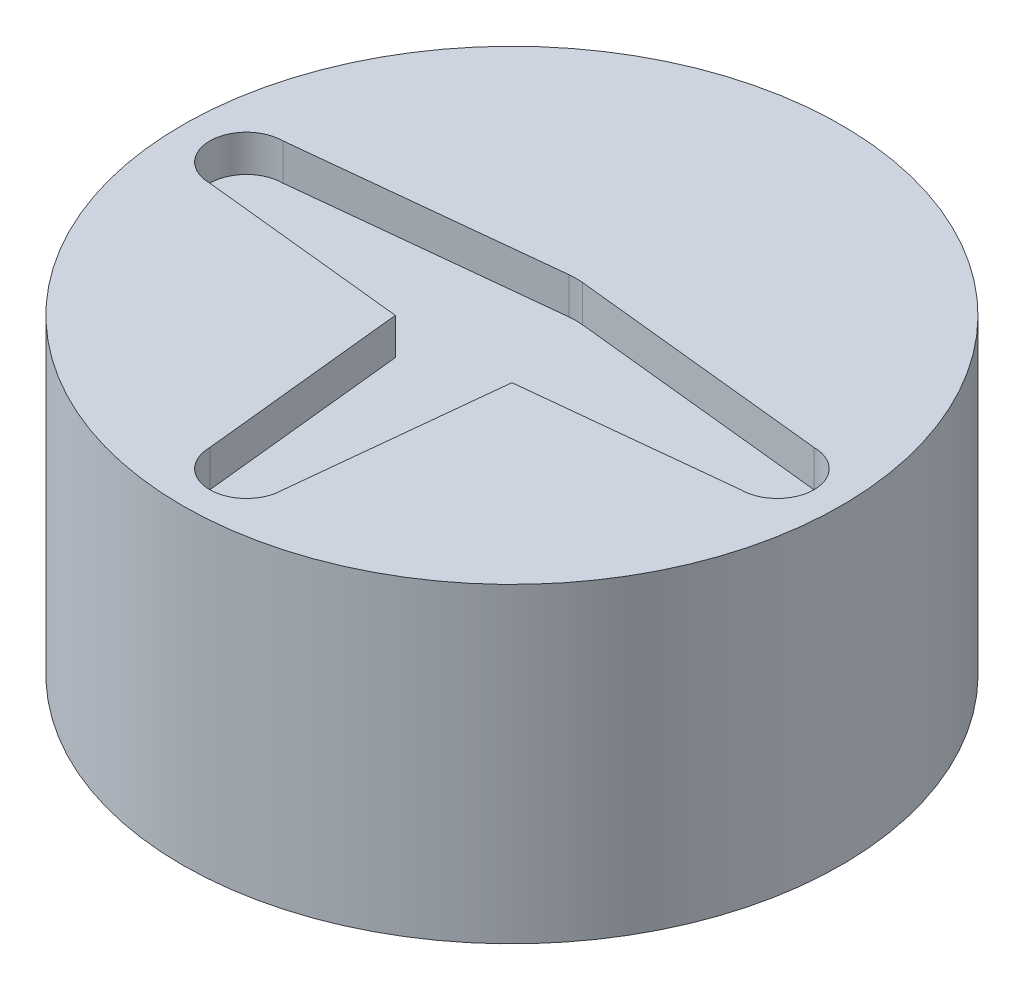
ISO-10303-21;
HEADER;
FILE_DESCRIPTION(('STEP AP214'),'2;1');
FILE_NAME('part.step','',(''),(''),'','','');
FILE_SCHEMA(('AUTOMOTIVE_DESIGN { 1 0 10303 214 1 1 1 1 }'));
ENDSEC;
DATA;
#1=APPLICATION_CONTEXT('core data for automotive mechanical design processes');
#2=APPLICATION_PROTOCOL_DEFINITION('international standard','automotive_design',2000,#1);
#3=PRODUCT_CONTEXT('',#1,'mechanical');
#4=PRODUCT('Part','Part','',(#3));
#5=PRODUCT_RELATED_PRODUCT_CATEGORY('part','',(#4));
#6=PRODUCT_DEFINITION_FORMATION('','',#4);
#7=PRODUCT_DEFINITION_CONTEXT('part definition',#1,'design');
#8=PRODUCT_DEFINITION('design','',#6,#7);
#9=PRODUCT_DEFINITION_SHAPE('','',#8);
#10=(LENGTH_UNIT() NAMED_UNIT(*) SI_UNIT(.MILLI.,.METRE.));
#11=(NAMED_UNIT(*) PLANE_ANGLE_UNIT() SI_UNIT($,.RADIAN.));
#12=(NAMED_UNIT(*) SI_UNIT($,.STERADIAN.) SOLID_ANGLE_UNIT());
#13=UNCERTAINTY_MEASURE_WITH_UNIT(LENGTH_MEASURE(1.E-05),#10,'distance_accuracy_value','');
#14=(GEOMETRIC_REPRESENTATION_CONTEXT(3) GLOBAL_UNCERTAINTY_ASSIGNED_CONTEXT((#13)) GLOBAL_UNIT_ASSIGNED_CONTEXT((#10,
#11,#12)) REPRESENTATION_CONTEXT('',''));
#15=CARTESIAN_POINT('',(0.,0.,0.));
#16=DIRECTION('',(0.,0.,1.));
#17=DIRECTION('',(1.,0.,0.));
#18=AXIS2_PLACEMENT_3D('',#15,#16,#17);
#19=CARTESIAN_POINT('',(0.,17.,0.));
#20=DIRECTION('',(0.,-1.,0.));
#21=DIRECTION('',(0.,0.,-1.));
#22=AXIS2_PLACEMENT_3D('',#19,#20,#21);
#23=CYLINDRICAL_SURFACE('',#22,18.);
#24=CARTESIAN_POINT('',(0.,17.,0.));
#25=DIRECTION('',(0.,1.,0.));
#26=DIRECTION('',(0.,0.,1.));
#27=AXIS2_PLACEMENT_3D('',#24,#25,#26);
#28=CIRCLE('',#27,18.);
#29=CARTESIAN_POINT('',(0.,17.,18.));
#30=VERTEX_POINT('',#29);
#31=EDGE_CURVE('E11',#30,#30,#28,.T.);
#32=ORIENTED_EDGE('',*,*,#31,.F.);
#33=EDGE_LOOP('',(#32));
#34=FACE_BOUND('',#33,.T.);
#35=CARTESIAN_POINT('',(0.,0.,0.));
#36=DIRECTION('',(0.,1.,0.));
#37=DIRECTION('',(0.,0.,1.));
#38=AXIS2_PLACEMENT_3D('',#35,#36,#37);
#39=CIRCLE('',#38,18.);
#40=CARTESIAN_POINT('',(0.,0.,18.));
#41=VERTEX_POINT('',#40);
#42=EDGE_CURVE('E42',#41,#41,#39,.T.);
#43=ORIENTED_EDGE('',*,*,#42,.T.);
#44=EDGE_LOOP('',(#43));
#45=FACE_BOUND('',#44,.T.);
#46=ADVANCED_FACE('F39',(#34,#45),#23,.T.);
#47=CARTESIAN_POINT('',(0.,17.,0.));
#48=DIRECTION('',(0.,1.,0.));
#49=DIRECTION('',(0.,0.,1.));
#50=AXIS2_PLACEMENT_3D('',#47,#48,#49);
#51=PLANE('',#50);
#52=DIRECTION('',(0.104199109418575,0.,-0.994556456716448));
#53=VECTOR('',#52,1.);
#54=CARTESIAN_POINT('',(1.99999999999508,17.,14.4999999999985));
#55=LINE('',#54,#53);
#56=CARTESIAN_POINT('',(1.99999999999508,17.,14.4999999999985));
#57=VERTEX_POINT('',#56);
#58=CARTESIAN_POINT('',(3.18542186075908,17.,3.18542186075878));
#59=VERTEX_POINT('',#58);
#60=EDGE_CURVE('E54',#57,#59,#55,.T.);
#61=ORIENTED_EDGE('',*,*,#60,.F.);
#62=CARTESIAN_POINT('',(-4.92010945873922E-12,17.,14.4999999999982));
#63=DIRECTION('',(0.,1.,0.));
#64=DIRECTION('',(0.,0.,1.));
#65=AXIS2_PLACEMENT_3D('',#62,#63,#64);
#66=CIRCLE('',#65,2.);
#67=CARTESIAN_POINT('',(-2.00000000000492,17.,14.4999999998284));
#68=VERTEX_POINT('',#67);
#69=EDGE_CURVE('E165',#68,#57,#66,.T.);
#70=ORIENTED_EDGE('',*,*,#69,.F.);
#71=DIRECTION('',(0.104199109419498,0.,0.994556456716351));
#72=VECTOR('',#71,1.);
#73=CARTESIAN_POINT('',(-2.00000000000492,17.,14.4999999998284));
#74=LINE('',#73,#72);
#75=CARTESIAN_POINT('',(-3.18542186076191,17.,3.1854218607568));
#76=VERTEX_POINT('',#75);
#77=EDGE_CURVE('E169',#76,#68,#74,.T.);
#78=ORIENTED_EDGE('',*,*,#77,.F.);
#79=DIRECTION('',(0.994556456716432,0.,0.104199109418732));
#80=VECTOR('',#79,1.);
#81=CARTESIAN_POINT('',(-14.5000000000015,17.,1.99999999999101));
#82=LINE('',#81,#80);
#83=CARTESIAN_POINT('',(-14.5000000000009,17.,1.99999999999101));
#84=VERTEX_POINT('',#83);
#85=EDGE_CURVE('E224',#84,#76,#82,.T.);
#86=ORIENTED_EDGE('',*,*,#85,.F.);
#87=CARTESIAN_POINT('',(-14.5000000000009,17.,-8.98760232903584E-12));
#88=DIRECTION('',(0.,1.,0.));
#89=DIRECTION('',(0.,0.,1.));
#90=AXIS2_PLACEMENT_3D('',#87,#88,#89);
#91=CIRCLE('',#90,2.);
#92=CARTESIAN_POINT('',(-14.4999999998307,17.,-2.00000000000899));
#93=VERTEX_POINT('',#92);
#94=EDGE_CURVE('E220',#93,#84,#91,.T.);
#95=ORIENTED_EDGE('',*,*,#94,.F.);
#96=DIRECTION('',(-0.994556456716401,0.,0.104199109419028));
#97=VECTOR('',#96,1.);
#98=CARTESIAN_POINT('',(-14.4999999998307,17.,-2.00000000000899));
#99=LINE('',#98,#97);
#100=CARTESIAN_POINT('',(-0.364696882966599,17.,-3.48094759850741));
#101=VERTEX_POINT('',#100);
#102=EDGE_CURVE('E216',#101,#93,#99,.T.);
#103=ORIENTED_EDGE('',*,*,#102,.F.);
#104=CARTESIAN_POINT('',(0.,17.,0.));
#105=DIRECTION('',(0.,1.,0.));
#106=DIRECTION('',(0.,0.,1.));
#107=AXIS2_PLACEMENT_3D('',#104,#105,#106);
#108=CIRCLE('',#107,3.50000000000001);
#109=CARTESIAN_POINT('',(0.364696882964465,17.,-3.48094759850762));
#110=VERTEX_POINT('',#109);
#111=EDGE_CURVE('E212',#110,#101,#108,.T.);
#112=ORIENTED_EDGE('',*,*,#111,.F.);
#113=DIRECTION('',(-0.994556456716464,0.,-0.104199109418418));
#114=VECTOR('',#113,1.);
#115=CARTESIAN_POINT('',(14.5,17.,-2.));
#116=LINE('',#115,#114);
#117=CARTESIAN_POINT('',(14.5,17.,-2.));
#118=VERTEX_POINT('',#117);
#119=EDGE_CURVE('E208',#118,#110,#116,.T.);
#120=ORIENTED_EDGE('',*,*,#119,.F.);
#121=CARTESIAN_POINT('',(14.5,17.,0.));
#122=DIRECTION('',(0.,1.,0.));
#123=DIRECTION('',(0.,0.,1.));
#124=AXIS2_PLACEMENT_3D('',#121,#122,#123);
#125=CIRCLE('',#124,2.);
#126=CARTESIAN_POINT('',(14.4999999998305,17.,2.));
#127=VERTEX_POINT('',#126);
#128=EDGE_CURVE('E204',#127,#118,#125,.T.);
#129=ORIENTED_EDGE('',*,*,#128,.F.);
#130=DIRECTION('',(0.994556456716335,0.,-0.104199109419655));
#131=VECTOR('',#130,1.);
#132=CARTESIAN_POINT('',(14.4999999998305,17.,2.));
#133=LINE('',#132,#131);
#134=EDGE_CURVE('E201',#59,#127,#133,.T.);
#135=ORIENTED_EDGE('',*,*,#134,.F.);
#136=EDGE_LOOP('',(#61,#70,#78,#86,#95,#103,#112,#120,#129,#135));
#137=FACE_BOUND('',#136,.T.);
#138=ORIENTED_EDGE('',*,*,#31,.T.);
#139=EDGE_LOOP('',(#138));
#140=FACE_BOUND('',#139,.T.);
#141=ADVANCED_FACE('F326',(#137,#140),#51,.T.);
#142=CARTESIAN_POINT('',(0.,0.,0.));
#143=DIRECTION('',(0.,1.,0.));
#144=DIRECTION('',(0.,0.,1.));
#145=AXIS2_PLACEMENT_3D('',#142,#143,#144);
#146=PLANE('',#145);
#147=DIRECTION('',(0.,0.,-1.));
#148=VECTOR('',#147,1.);
#149=CARTESIAN_POINT('',(13.,0.,7.));
#150=LINE('',#149,#148);
#151=CARTESIAN_POINT('',(13.,0.,7.));
#152=VERTEX_POINT('',#151);
#153=CARTESIAN_POINT('',(13.,0.,-7.));
#154=VERTEX_POINT('',#153);
#155=EDGE_CURVE('E275',#152,#154,#150,.T.);
#156=ORIENTED_EDGE('',*,*,#155,.T.);
#157=DIRECTION('',(1.,0.,0.));
#158=VECTOR('',#157,1.);
#159=CARTESIAN_POINT('',(-13.,0.,-7.));
#160=LINE('',#159,#158);
#161=CARTESIAN_POINT('',(-13.,0.,-7.));
#162=VERTEX_POINT('',#161);
#163=EDGE_CURVE('E62',#162,#154,#160,.T.);
#164=ORIENTED_EDGE('',*,*,#163,.F.);
#165=DIRECTION('',(0.,0.,-1.));
#166=VECTOR('',#165,1.);
#167=CARTESIAN_POINT('',(-13.,0.,7.));
#168=LINE('',#167,#166);
#169=CARTESIAN_POINT('',(-13.,0.,7.));
#170=VERTEX_POINT('',#169);
#171=EDGE_CURVE('E262',#170,#162,#168,.T.);
#172=ORIENTED_EDGE('',*,*,#171,.F.);
#173=DIRECTION('',(1.,0.,0.));
#174=VECTOR('',#173,1.);
#175=CARTESIAN_POINT('',(-13.,0.,7.));
#176=LINE('',#175,#174);
#177=EDGE_CURVE('E279',#170,#152,#176,.T.);
#178=ORIENTED_EDGE('',*,*,#177,.T.);
#179=EDGE_LOOP('',(#156,#164,#172,#178));
#180=FACE_BOUND('',#179,.T.);
#181=ORIENTED_EDGE('',*,*,#42,.F.);
#182=EDGE_LOOP('',(#181));
#183=FACE_BOUND('',#182,.T.);
#184=ADVANCED_FACE('F303',(#180,#183),#146,.F.);
#185=CARTESIAN_POINT('',(-13.,5.25,-7.));
#186=DIRECTION('',(0.,0.,-1.));
#187=DIRECTION('',(-1.,0.,0.));
#188=AXIS2_PLACEMENT_3D('',#185,#186,#187);
#189=PLANE('',#188);
#190=ORIENTED_EDGE('',*,*,#163,.T.);
#191=DIRECTION('',(0.,-1.,0.));
#192=VECTOR('',#191,1.);
#193=CARTESIAN_POINT('',(13.,5.25,-7.));
#194=LINE('',#193,#192);
#195=CARTESIAN_POINT('',(13.,5.25,-7.));
#196=VERTEX_POINT('',#195);
#197=EDGE_CURVE('E272',#196,#154,#194,.T.);
#198=ORIENTED_EDGE('',*,*,#197,.F.);
#199=DIRECTION('',(1.,0.,0.));
#200=VECTOR('',#199,1.);
#201=CARTESIAN_POINT('',(-13.,5.25,-7.));
#202=LINE('',#201,#200);
#203=CARTESIAN_POINT('',(-13.,5.25,-7.));
#204=VERTEX_POINT('',#203);
#205=EDGE_CURVE('E257',#204,#196,#202,.T.);
#206=ORIENTED_EDGE('',*,*,#205,.F.);
#207=DIRECTION('',(0.,-1.,0.));
#208=VECTOR('',#207,1.);
#209=CARTESIAN_POINT('',(-13.,5.25,-7.));
#210=LINE('',#209,#208);
#211=EDGE_CURVE('E286',#204,#162,#210,.T.);
#212=ORIENTED_EDGE('',*,*,#211,.T.);
#213=EDGE_LOOP('',(#190,#198,#206,#212));
#214=FACE_BOUND('',#213,.T.);
#215=ADVANCED_FACE('F313',(#214),#189,.F.);
#216=CARTESIAN_POINT('',(-13.,5.25,7.));
#217=DIRECTION('',(-1.,0.,0.));
#218=DIRECTION('',(0.,0.,1.));
#219=AXIS2_PLACEMENT_3D('',#216,#217,#218);
#220=PLANE('',#219);
#221=ORIENTED_EDGE('',*,*,#171,.T.);
#222=ORIENTED_EDGE('',*,*,#211,.F.);
#223=DIRECTION('',(0.,0.,-1.));
#224=VECTOR('',#223,1.);
#225=CARTESIAN_POINT('',(-13.,5.25,7.));
#226=LINE('',#225,#224);
#227=CARTESIAN_POINT('',(-13.,5.25,7.));
#228=VERTEX_POINT('',#227);
#229=EDGE_CURVE('E268',#228,#204,#226,.T.);
#230=ORIENTED_EDGE('',*,*,#229,.F.);
#231=DIRECTION('',(0.,-1.,0.));
#232=VECTOR('',#231,1.);
#233=CARTESIAN_POINT('',(-13.,5.25,7.));
#234=LINE('',#233,#232);
#235=EDGE_CURVE('E289',#228,#170,#234,.T.);
#236=ORIENTED_EDGE('',*,*,#235,.T.);
#237=EDGE_LOOP('',(#221,#222,#230,#236));
#238=FACE_BOUND('',#237,.T.);
#239=ADVANCED_FACE('F315',(#238),#220,.F.);
#240=CARTESIAN_POINT('',(-13.,5.25,7.));
#241=DIRECTION('',(0.,0.,-1.));
#242=DIRECTION('',(-1.,0.,0.));
#243=AXIS2_PLACEMENT_3D('',#240,#241,#242);
#244=PLANE('',#243);
#245=ORIENTED_EDGE('',*,*,#177,.F.);
#246=ORIENTED_EDGE('',*,*,#235,.F.);
#247=DIRECTION('',(1.,0.,0.));
#248=VECTOR('',#247,1.);
#249=CARTESIAN_POINT('',(-13.,5.25,7.));
#250=LINE('',#249,#248);
#251=CARTESIAN_POINT('',(13.,5.25,7.));
#252=VERTEX_POINT('',#251);
#253=EDGE_CURVE('E265',#228,#252,#250,.T.);
#254=ORIENTED_EDGE('',*,*,#253,.T.);
#255=DIRECTION('',(0.,-1.,0.));
#256=VECTOR('',#255,1.);
#257=CARTESIAN_POINT('',(13.,5.25,7.));
#258=LINE('',#257,#256);
#259=EDGE_CURVE('E292',#252,#152,#258,.T.);
#260=ORIENTED_EDGE('',*,*,#259,.T.);
#261=EDGE_LOOP('',(#245,#246,#254,#260));
#262=FACE_BOUND('',#261,.T.);
#263=ADVANCED_FACE('F308',(#262),#244,.T.);
#264=CARTESIAN_POINT('',(13.,5.25,7.));
#265=DIRECTION('',(-1.,0.,0.));
#266=DIRECTION('',(0.,0.,1.));
#267=AXIS2_PLACEMENT_3D('',#264,#265,#266);
#268=PLANE('',#267);
#269=ORIENTED_EDGE('',*,*,#155,.F.);
#270=ORIENTED_EDGE('',*,*,#259,.F.);
#271=DIRECTION('',(0.,0.,-1.));
#272=VECTOR('',#271,1.);
#273=CARTESIAN_POINT('',(13.,5.25,7.));
#274=LINE('',#273,#272);
#275=EDGE_CURVE('E261',#252,#196,#274,.T.);
#276=ORIENTED_EDGE('',*,*,#275,.T.);
#277=ORIENTED_EDGE('',*,*,#197,.T.);
#278=EDGE_LOOP('',(#269,#270,#276,#277));
#279=FACE_BOUND('',#278,.T.);
#280=ADVANCED_FACE('F298',(#279),#268,.T.);
#281=CARTESIAN_POINT('',(0.,5.25,0.));
#282=DIRECTION('',(0.,1.,0.));
#283=DIRECTION('',(0.,0.,1.));
#284=AXIS2_PLACEMENT_3D('',#281,#282,#283);
#285=PLANE('',#284);
#286=ORIENTED_EDGE('',*,*,#205,.T.);
#287=ORIENTED_EDGE('',*,*,#275,.F.);
#288=ORIENTED_EDGE('',*,*,#253,.F.);
#289=ORIENTED_EDGE('',*,*,#229,.T.);
#290=EDGE_LOOP('',(#286,#287,#288,#289));
#291=FACE_BOUND('',#290,.T.);
#292=ADVANCED_FACE('F311',(#291),#285,.F.);
#293=CARTESIAN_POINT('',(1.99999999999508,15.,14.4999999999985));
#294=DIRECTION('',(0.994556456716448,0.,0.104199109418575));
#295=DIRECTION('',(0.104199109418576,0.,-0.994556456716448));
#296=AXIS2_PLACEMENT_3D('',#293,#294,#295);
#297=PLANE('',#296);
#298=ORIENTED_EDGE('',*,*,#60,.T.);
#299=DIRECTION('',(0.,1.,0.));
#300=VECTOR('',#299,1.);
#301=CARTESIAN_POINT('',(3.18542186075908,15.,3.18542186075878));
#302=LINE('',#301,#300);
#303=CARTESIAN_POINT('',(3.18542186075908,15.,3.18542186075878));
#304=VERTEX_POINT('',#303);
#305=EDGE_CURVE('E139',#304,#59,#302,.T.);
#306=ORIENTED_EDGE('',*,*,#305,.F.);
#307=DIRECTION('',(0.104199109418575,0.,-0.994556456716448));
#308=VECTOR('',#307,1.);
#309=CARTESIAN_POINT('',(1.99999999999508,15.,14.4999999999985));
#310=LINE('',#309,#308);
#311=CARTESIAN_POINT('',(1.99999999999508,15.,14.4999999999985));
#312=VERTEX_POINT('',#311);
#313=EDGE_CURVE('E143',#312,#304,#310,.T.);
#314=ORIENTED_EDGE('',*,*,#313,.F.);
#315=DIRECTION('',(0.,1.,0.));
#316=VECTOR('',#315,1.);
#317=CARTESIAN_POINT('',(1.99999999999508,15.,14.4999999999985));
#318=LINE('',#317,#316);
#319=EDGE_CURVE('E231',#312,#57,#318,.T.);
#320=ORIENTED_EDGE('',*,*,#319,.T.);
#321=EDGE_LOOP('',(#298,#306,#314,#320));
#322=FACE_BOUND('',#321,.T.);
#323=ADVANCED_FACE('F141',(#322),#297,.F.);
#324=CARTESIAN_POINT('',(-4.92010945873922E-12,15.,14.4999999999982));
#325=DIRECTION('',(0.,1.,0.));
#326=DIRECTION('',(0.,0.,1.));
#327=AXIS2_PLACEMENT_3D('',#324,#325,#326);
#328=CYLINDRICAL_SURFACE('',#327,2.);
#329=ORIENTED_EDGE('',*,*,#69,.T.);
#330=ORIENTED_EDGE('',*,*,#319,.F.);
#331=CARTESIAN_POINT('',(-4.92010945873922E-12,15.,14.4999999999982));
#332=DIRECTION('',(0.,1.,0.));
#333=DIRECTION('',(0.,0.,1.));
#334=AXIS2_PLACEMENT_3D('',#331,#332,#333);
#335=CIRCLE('',#334,2.);
#336=CARTESIAN_POINT('',(-2.00000000000492,15.,14.4999999998284));
#337=VERTEX_POINT('',#336);
#338=EDGE_CURVE('E150',#337,#312,#335,.T.);
#339=ORIENTED_EDGE('',*,*,#338,.F.);
#340=DIRECTION('',(0.,1.,0.));
#341=VECTOR('',#340,1.);
#342=CARTESIAN_POINT('',(-2.00000000000492,15.,14.4999999998284));
#343=LINE('',#342,#341);
#344=EDGE_CURVE('E234',#337,#68,#343,.T.);
#345=ORIENTED_EDGE('',*,*,#344,.T.);
#346=EDGE_LOOP('',(#329,#330,#339,#345));
#347=FACE_BOUND('',#346,.T.);
#348=ADVANCED_FACE('F349',(#347),#328,.F.);
#349=CARTESIAN_POINT('',(-2.00000000000492,15.,14.4999999998284));
#350=DIRECTION('',(-0.994556456716351,0.,0.104199109419498));
#351=DIRECTION('',(0.104199109419498,0.,0.994556456716351));
#352=AXIS2_PLACEMENT_3D('',#349,#350,#351);
#353=PLANE('',#352);
#354=ORIENTED_EDGE('',*,*,#77,.T.);
#355=ORIENTED_EDGE('',*,*,#344,.F.);
#356=DIRECTION('',(0.104199109419498,0.,0.994556456716351));
#357=VECTOR('',#356,1.);
#358=CARTESIAN_POINT('',(-2.00000000000492,15.,14.4999999998284));
#359=LINE('',#358,#357);
#360=CARTESIAN_POINT('',(-3.18542186076191,15.,3.1854218607568));
#361=VERTEX_POINT('',#360);
#362=EDGE_CURVE('E194',#361,#337,#359,.T.);
#363=ORIENTED_EDGE('',*,*,#362,.F.);
#364=DIRECTION('',(0.,1.,0.));
#365=VECTOR('',#364,1.);
#366=CARTESIAN_POINT('',(-3.18542186076191,15.,3.1854218607568));
#367=LINE('',#366,#365);
#368=EDGE_CURVE('E237',#361,#76,#367,.T.);
#369=ORIENTED_EDGE('',*,*,#368,.T.);
#370=EDGE_LOOP('',(#354,#355,#363,#369));
#371=FACE_BOUND('',#370,.T.);
#372=ADVANCED_FACE('F377',(#371),#353,.F.);
#373=CARTESIAN_POINT('',(-14.5000000000015,15.,1.99999999999101));
#374=DIRECTION('',(-0.104199109418732,0.,0.994556456716432));
#375=DIRECTION('',(0.994556456716432,0.,0.104199109418732));
#376=AXIS2_PLACEMENT_3D('',#373,#374,#375);
#377=PLANE('',#376);
#378=ORIENTED_EDGE('',*,*,#85,.T.);
#379=ORIENTED_EDGE('',*,*,#368,.F.);
#380=DIRECTION('',(0.994556456716432,0.,0.104199109418732));
#381=VECTOR('',#380,1.);
#382=CARTESIAN_POINT('',(-14.5000000000015,15.,1.99999999999101));
#383=LINE('',#382,#381);
#384=CARTESIAN_POINT('',(-14.5000000000009,15.,1.99999999999101));
#385=VERTEX_POINT('',#384);
#386=EDGE_CURVE('E190',#385,#361,#383,.T.);
#387=ORIENTED_EDGE('',*,*,#386,.F.);
#388=DIRECTION('',(0.,1.,0.));
#389=VECTOR('',#388,1.);
#390=CARTESIAN_POINT('',(-14.5000000000009,15.,1.99999999999101));
#391=LINE('',#390,#389);
#392=EDGE_CURVE('E240',#385,#84,#391,.T.);
#393=ORIENTED_EDGE('',*,*,#392,.T.);
#394=EDGE_LOOP('',(#378,#379,#387,#393));
#395=FACE_BOUND('',#394,.T.);
#396=ADVANCED_FACE('F373',(#395),#377,.F.);
#397=CARTESIAN_POINT('',(-14.5000000000009,15.,-8.98760232903584E-12));
#398=DIRECTION('',(0.,1.,0.));
#399=DIRECTION('',(0.,0.,1.));
#400=AXIS2_PLACEMENT_3D('',#397,#398,#399);
#401=CYLINDRICAL_SURFACE('',#400,2.);
#402=ORIENTED_EDGE('',*,*,#94,.T.);
#403=ORIENTED_EDGE('',*,*,#392,.F.);
#404=CARTESIAN_POINT('',(-14.5000000000009,15.,-8.98760232903584E-12));
#405=DIRECTION('',(0.,1.,0.));
#406=DIRECTION('',(0.,0.,1.));
#407=AXIS2_PLACEMENT_3D('',#404,#405,#406);
#408=CIRCLE('',#407,2.);
#409=CARTESIAN_POINT('',(-14.4999999998307,15.,-2.00000000000899));
#410=VERTEX_POINT('',#409);
#411=EDGE_CURVE('E186',#410,#385,#408,.T.);
#412=ORIENTED_EDGE('',*,*,#411,.F.);
#413=DIRECTION('',(0.,1.,0.));
#414=VECTOR('',#413,1.);
#415=CARTESIAN_POINT('',(-14.4999999998307,15.,-2.00000000000899));
#416=LINE('',#415,#414);
#417=EDGE_CURVE('E243',#410,#93,#416,.T.);
#418=ORIENTED_EDGE('',*,*,#417,.T.);
#419=EDGE_LOOP('',(#402,#403,#412,#418));
#420=FACE_BOUND('',#419,.T.);
#421=ADVANCED_FACE('F369',(#420),#401,.F.);
#422=CARTESIAN_POINT('',(-14.4999999998307,15.,-2.00000000000899));
#423=DIRECTION('',(-0.104199109419028,0.,-0.994556456716401));
#424=DIRECTION('',(-0.994556456716401,0.,0.104199109419028));
#425=AXIS2_PLACEMENT_3D('',#422,#423,#424);
#426=PLANE('',#425);
#427=ORIENTED_EDGE('',*,*,#102,.T.);
#428=ORIENTED_EDGE('',*,*,#417,.F.);
#429=DIRECTION('',(-0.994556456716401,0.,0.104199109419028));
#430=VECTOR('',#429,1.);
#431=CARTESIAN_POINT('',(-14.4999999998307,15.,-2.00000000000899));
#432=LINE('',#431,#430);
#433=CARTESIAN_POINT('',(-0.364696882966599,15.,-3.48094759850741));
#434=VERTEX_POINT('',#433);
#435=EDGE_CURVE('E182',#434,#410,#432,.T.);
#436=ORIENTED_EDGE('',*,*,#435,.F.);
#437=DIRECTION('',(0.,1.,0.));
#438=VECTOR('',#437,1.);
#439=CARTESIAN_POINT('',(-0.364696882966599,15.,-3.48094759850741));
#440=LINE('',#439,#438);
#441=EDGE_CURVE('E246',#434,#101,#440,.T.);
#442=ORIENTED_EDGE('',*,*,#441,.T.);
#443=EDGE_LOOP('',(#427,#428,#436,#442));
#444=FACE_BOUND('',#443,.T.);
#445=ADVANCED_FACE('F365',(#444),#426,.F.);
#446=CARTESIAN_POINT('',(0.,15.,0.));
#447=DIRECTION('',(0.,1.,0.));
#448=DIRECTION('',(0.,0.,1.));
#449=AXIS2_PLACEMENT_3D('',#446,#447,#448);
#450=CYLINDRICAL_SURFACE('',#449,3.50000000000001);
#451=ORIENTED_EDGE('',*,*,#111,.T.);
#452=ORIENTED_EDGE('',*,*,#441,.F.);
#453=CARTESIAN_POINT('',(0.,15.,0.));
#454=DIRECTION('',(0.,1.,0.));
#455=DIRECTION('',(0.,0.,1.));
#456=AXIS2_PLACEMENT_3D('',#453,#454,#455);
#457=CIRCLE('',#456,3.50000000000001);
#458=CARTESIAN_POINT('',(0.364696882964465,15.,-3.48094759850762));
#459=VERTEX_POINT('',#458);
#460=EDGE_CURVE('E178',#459,#434,#457,.T.);
#461=ORIENTED_EDGE('',*,*,#460,.F.);
#462=DIRECTION('',(0.,1.,0.));
#463=VECTOR('',#462,1.);
#464=CARTESIAN_POINT('',(0.364696882964465,15.,-3.48094759850762));
#465=LINE('',#464,#463);
#466=EDGE_CURVE('E249',#459,#110,#465,.T.);
#467=ORIENTED_EDGE('',*,*,#466,.T.);
#468=EDGE_LOOP('',(#451,#452,#461,#467));
#469=FACE_BOUND('',#468,.T.);
#470=ADVANCED_FACE('F361',(#469),#450,.F.);
#471=CARTESIAN_POINT('',(14.5,15.,-2.));
#472=DIRECTION('',(0.104199109418418,0.,-0.994556456716465));
#473=DIRECTION('',(-0.994556456716464,0.,-0.104199109418418));
#474=AXIS2_PLACEMENT_3D('',#471,#472,#473);
#475=PLANE('',#474);
#476=ORIENTED_EDGE('',*,*,#119,.T.);
#477=ORIENTED_EDGE('',*,*,#466,.F.);
#478=DIRECTION('',(-0.994556456716464,0.,-0.104199109418418));
#479=VECTOR('',#478,1.);
#480=CARTESIAN_POINT('',(14.5,15.,-2.));
#481=LINE('',#480,#479);
#482=CARTESIAN_POINT('',(14.5,15.,-2.));
#483=VERTEX_POINT('',#482);
#484=EDGE_CURVE('E174',#483,#459,#481,.T.);
#485=ORIENTED_EDGE('',*,*,#484,.F.);
#486=DIRECTION('',(0.,1.,0.));
#487=VECTOR('',#486,1.);
#488=CARTESIAN_POINT('',(14.5,15.,-2.));
#489=LINE('',#488,#487);
#490=EDGE_CURVE('E252',#483,#118,#489,.T.);
#491=ORIENTED_EDGE('',*,*,#490,.T.);
#492=EDGE_LOOP('',(#476,#477,#485,#491));
#493=FACE_BOUND('',#492,.T.);
#494=ADVANCED_FACE('F357',(#493),#475,.F.);
#495=CARTESIAN_POINT('',(14.5,15.,0.));
#496=DIRECTION('',(0.,1.,0.));
#497=DIRECTION('',(0.,0.,1.));
#498=AXIS2_PLACEMENT_3D('',#495,#496,#497);
#499=CYLINDRICAL_SURFACE('',#498,2.);
#500=ORIENTED_EDGE('',*,*,#128,.T.);
#501=ORIENTED_EDGE('',*,*,#490,.F.);
#502=CARTESIAN_POINT('',(14.5,15.,0.));
#503=DIRECTION('',(0.,1.,0.));
#504=DIRECTION('',(0.,0.,1.));
#505=AXIS2_PLACEMENT_3D('',#502,#503,#504);
#506=CIRCLE('',#505,2.);
#507=CARTESIAN_POINT('',(14.4999999998305,15.,2.));
#508=VERTEX_POINT('',#507);
#509=EDGE_CURVE('E159',#508,#483,#506,.T.);
#510=ORIENTED_EDGE('',*,*,#509,.F.);
#511=DIRECTION('',(0.,1.,0.));
#512=VECTOR('',#511,1.);
#513=CARTESIAN_POINT('',(14.4999999998305,15.,2.));
#514=LINE('',#513,#512);
#515=EDGE_CURVE('E149',#508,#127,#514,.T.);
#516=ORIENTED_EDGE('',*,*,#515,.T.);
#517=EDGE_LOOP('',(#500,#501,#510,#516));
#518=FACE_BOUND('',#517,.T.);
#519=ADVANCED_FACE('F354',(#518),#499,.F.);
#520=CARTESIAN_POINT('',(14.4999999998305,15.,2.));
#521=DIRECTION('',(0.104199109419655,0.,0.994556456716335));
#522=DIRECTION('',(0.994556456716335,0.,-0.104199109419655));
#523=AXIS2_PLACEMENT_3D('',#520,#521,#522);
#524=PLANE('',#523);
#525=ORIENTED_EDGE('',*,*,#134,.T.);
#526=ORIENTED_EDGE('',*,*,#515,.F.);
#527=DIRECTION('',(0.994556456716335,0.,-0.104199109419655));
#528=VECTOR('',#527,1.);
#529=CARTESIAN_POINT('',(14.4999999998305,15.,2.));
#530=LINE('',#529,#528);
#531=EDGE_CURVE('E153',#304,#508,#530,.T.);
#532=ORIENTED_EDGE('',*,*,#531,.F.);
#533=ORIENTED_EDGE('',*,*,#305,.T.);
#534=EDGE_LOOP('',(#525,#526,#532,#533));
#535=FACE_BOUND('',#534,.T.);
#536=ADVANCED_FACE('F154',(#535),#524,.F.);
#537=CARTESIAN_POINT('',(14.5,15.,0.));
#538=DIRECTION('',(0.,1.,0.));
#539=DIRECTION('',(0.,0.,1.));
#540=AXIS2_PLACEMENT_3D('',#537,#538,#539);
#541=PLANE('',#540);
#542=ORIENTED_EDGE('',*,*,#313,.T.);
#543=ORIENTED_EDGE('',*,*,#531,.T.);
#544=ORIENTED_EDGE('',*,*,#509,.T.);
#545=ORIENTED_EDGE('',*,*,#484,.T.);
#546=ORIENTED_EDGE('',*,*,#460,.T.);
#547=ORIENTED_EDGE('',*,*,#435,.T.);
#548=ORIENTED_EDGE('',*,*,#411,.T.);
#549=ORIENTED_EDGE('',*,*,#386,.T.);
#550=ORIENTED_EDGE('',*,*,#362,.T.);
#551=ORIENTED_EDGE('',*,*,#338,.T.);
#552=EDGE_LOOP('',(#542,#543,#544,#545,#546,#547,#548,#549,#550,#551));
#553=FACE_BOUND('',#552,.T.);
#554=ADVANCED_FACE('F161',(#553),#541,.T.);
#555=CLOSED_SHELL('',(#46,#141,#184,#215,#239,#263,#280,#292,#323,#348,#372,#396,#421,#445,#470,
#494,#519,#536,#554));
#556=MANIFOLD_SOLID_BREP('B2',#555);
#557=ADVANCED_BREP_SHAPE_REPRESENTATION('',(#18,#556),#14);
#558=SHAPE_DEFINITION_REPRESENTATION(#9,#557);
ENDSEC;
END-ISO-10303-21;
